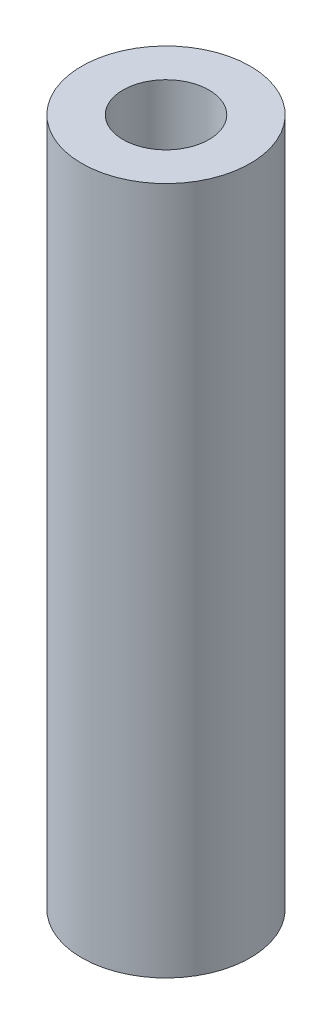
ISO-10303-21;
HEADER;
FILE_DESCRIPTION(('STEP AP214'),'2;1');
FILE_NAME('part.step','',(''),(''),'','','');
FILE_SCHEMA(('AUTOMOTIVE_DESIGN { 1 0 10303 214 1 1 1 1 }'));
ENDSEC;
DATA;
#1=APPLICATION_CONTEXT('core data for automotive mechanical design processes');
#2=APPLICATION_PROTOCOL_DEFINITION('international standard','automotive_design',2000,#1);
#3=PRODUCT_CONTEXT('',#1,'mechanical');
#4=PRODUCT('Part','Part','',(#3));
#5=PRODUCT_RELATED_PRODUCT_CATEGORY('part','',(#4));
#6=PRODUCT_DEFINITION_FORMATION('','',#4);
#7=PRODUCT_DEFINITION_CONTEXT('part definition',#1,'design');
#8=PRODUCT_DEFINITION('design','',#6,#7);
#9=PRODUCT_DEFINITION_SHAPE('','',#8);
#10=(LENGTH_UNIT() NAMED_UNIT(*) SI_UNIT(.MILLI.,.METRE.));
#11=(NAMED_UNIT(*) PLANE_ANGLE_UNIT() SI_UNIT($,.RADIAN.));
#12=(NAMED_UNIT(*) SI_UNIT($,.STERADIAN.) SOLID_ANGLE_UNIT());
#13=UNCERTAINTY_MEASURE_WITH_UNIT(LENGTH_MEASURE(1.E-05),#10,'distance_accuracy_value','');
#14=(GEOMETRIC_REPRESENTATION_CONTEXT(3) GLOBAL_UNCERTAINTY_ASSIGNED_CONTEXT((#13)) GLOBAL_UNIT_ASSIGNED_CONTEXT((#10,
#11,#12)) REPRESENTATION_CONTEXT('',''));
#15=CARTESIAN_POINT('',(0.,0.,0.));
#16=DIRECTION('',(0.,0.,1.));
#17=DIRECTION('',(1.,0.,0.));
#18=AXIS2_PLACEMENT_3D('',#15,#16,#17);
#19=CARTESIAN_POINT('',(0.,25.4,0.));
#20=DIRECTION('',(0.,1.,0.));
#21=DIRECTION('',(0.,0.,1.));
#22=AXIS2_PLACEMENT_3D('',#19,#20,#21);
#23=PLANE('',#22);
#24=CARTESIAN_POINT('',(0.,25.4,0.));
#25=DIRECTION('',(0.,1.,0.));
#26=DIRECTION('',(0.,0.,1.));
#27=AXIS2_PLACEMENT_3D('',#24,#25,#26);
#28=CIRCLE('',#27,3.1115);
#29=CARTESIAN_POINT('',(0.,25.4,3.1115));
#30=VERTEX_POINT('',#29);
#31=EDGE_CURVE('E10',#30,#30,#28,.T.);
#32=ORIENTED_EDGE('',*,*,#31,.T.);
#33=EDGE_LOOP('',(#32));
#34=FACE_BOUND('',#33,.T.);
#35=CARTESIAN_POINT('',(0.,25.4,0.));
#36=DIRECTION('',(0.,1.,0.));
#37=DIRECTION('',(0.,0.,1.));
#38=AXIS2_PLACEMENT_3D('',#35,#36,#37);
#39=CIRCLE('',#38,1.5875);
#40=CARTESIAN_POINT('',(0.,25.4,1.5875));
#41=VERTEX_POINT('',#40);
#42=EDGE_CURVE('E48',#41,#41,#39,.T.);
#43=ORIENTED_EDGE('',*,*,#42,.F.);
#44=EDGE_LOOP('',(#43));
#45=FACE_BOUND('',#44,.T.);
#46=ADVANCED_FACE('F37',(#34,#45),#23,.T.);
#47=CARTESIAN_POINT('',(0.,0.,0.));
#48=DIRECTION('',(0.,1.,0.));
#49=DIRECTION('',(0.,0.,1.));
#50=AXIS2_PLACEMENT_3D('',#47,#48,#49);
#51=PLANE('',#50);
#52=CARTESIAN_POINT('',(0.,0.,0.));
#53=DIRECTION('',(0.,1.,0.));
#54=DIRECTION('',(0.,0.,1.));
#55=AXIS2_PLACEMENT_3D('',#52,#53,#54);
#56=CIRCLE('',#55,3.1115);
#57=CARTESIAN_POINT('',(0.,0.,3.1115));
#58=VERTEX_POINT('',#57);
#59=EDGE_CURVE('E41',#58,#58,#56,.T.);
#60=ORIENTED_EDGE('',*,*,#59,.F.);
#61=EDGE_LOOP('',(#60));
#62=FACE_BOUND('',#61,.T.);
#63=CARTESIAN_POINT('',(0.,0.,0.));
#64=DIRECTION('',(0.,1.,0.));
#65=DIRECTION('',(0.,0.,1.));
#66=AXIS2_PLACEMENT_3D('',#63,#64,#65);
#67=CIRCLE('',#66,1.5875);
#68=CARTESIAN_POINT('',(0.,0.,1.5875));
#69=VERTEX_POINT('',#68);
#70=EDGE_CURVE('E50',#69,#69,#67,.T.);
#71=ORIENTED_EDGE('',*,*,#70,.T.);
#72=EDGE_LOOP('',(#71));
#73=FACE_BOUND('',#72,.T.);
#74=ADVANCED_FACE('F60',(#62,#73),#51,.F.);
#75=CARTESIAN_POINT('',(0.,25.4,0.));
#76=DIRECTION('',(0.,-1.,0.));
#77=DIRECTION('',(0.,0.,-1.));
#78=AXIS2_PLACEMENT_3D('',#75,#76,#77);
#79=CYLINDRICAL_SURFACE('',#78,3.1115);
#80=ORIENTED_EDGE('',*,*,#31,.F.);
#81=EDGE_LOOP('',(#80));
#82=FACE_BOUND('',#81,.T.);
#83=ORIENTED_EDGE('',*,*,#59,.T.);
#84=EDGE_LOOP('',(#83));
#85=FACE_BOUND('',#84,.T.);
#86=ADVANCED_FACE('F39',(#82,#85),#79,.T.);
#87=CARTESIAN_POINT('',(0.,25.4,0.));
#88=DIRECTION('',(0.,-1.,0.));
#89=DIRECTION('',(0.,0.,-1.));
#90=AXIS2_PLACEMENT_3D('',#87,#88,#89);
#91=CYLINDRICAL_SURFACE('',#90,1.5875);
#92=ORIENTED_EDGE('',*,*,#42,.T.);
#93=EDGE_LOOP('',(#92));
#94=FACE_BOUND('',#93,.T.);
#95=ORIENTED_EDGE('',*,*,#70,.F.);
#96=EDGE_LOOP('',(#95));
#97=FACE_BOUND('',#96,.T.);
#98=ADVANCED_FACE('F56',(#94,#97),#91,.F.);
#99=CLOSED_SHELL('',(#46,#74,#86,#98));
#100=MANIFOLD_SOLID_BREP('B2',#99);
#101=ADVANCED_BREP_SHAPE_REPRESENTATION('',(#18,#100),#14);
#102=SHAPE_DEFINITION_REPRESENTATION(#9,#101);
ENDSEC;
END-ISO-10303-21;
